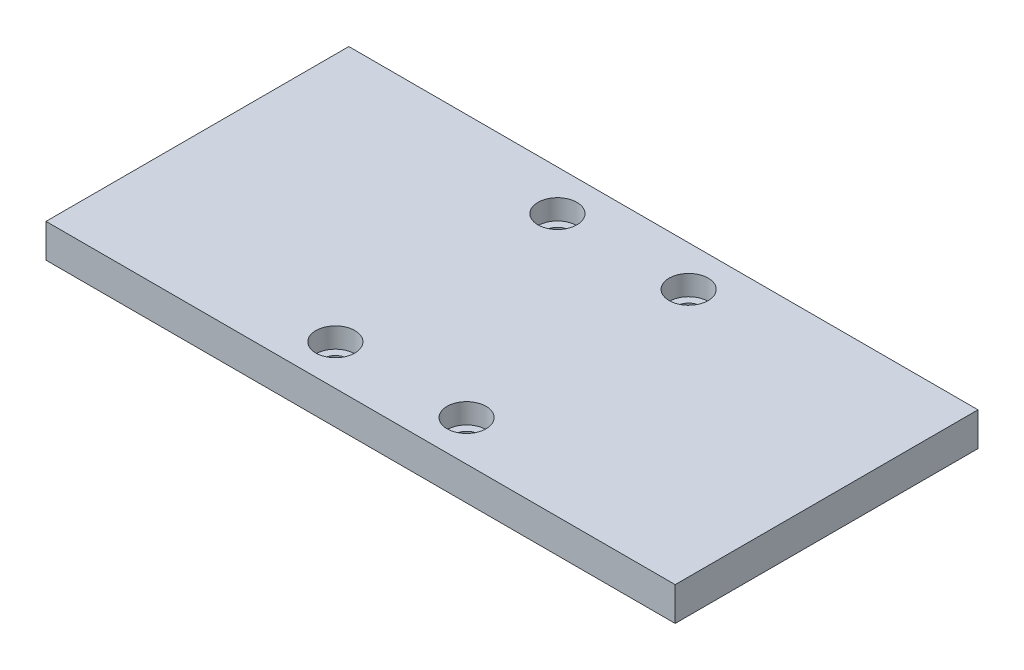
ISO-10303-21;
HEADER;
FILE_DESCRIPTION(('STEP AP214'),'2;1');
FILE_NAME('part.step','',(''),(''),'','','');
FILE_SCHEMA(('AUTOMOTIVE_DESIGN { 1 0 10303 214 1 1 1 1 }'));
ENDSEC;
DATA;
#1=APPLICATION_CONTEXT('core data for automotive mechanical design processes');
#2=APPLICATION_PROTOCOL_DEFINITION('international standard','automotive_design',2000,#1);
#3=PRODUCT_CONTEXT('',#1,'mechanical');
#4=PRODUCT('Part','Part','',(#3));
#5=PRODUCT_RELATED_PRODUCT_CATEGORY('part','',(#4));
#6=PRODUCT_DEFINITION_FORMATION('','',#4);
#7=PRODUCT_DEFINITION_CONTEXT('part definition',#1,'design');
#8=PRODUCT_DEFINITION('design','',#6,#7);
#9=PRODUCT_DEFINITION_SHAPE('','',#8);
#10=(LENGTH_UNIT() NAMED_UNIT(*) SI_UNIT(.MILLI.,.METRE.));
#11=(NAMED_UNIT(*) PLANE_ANGLE_UNIT() SI_UNIT($,.RADIAN.));
#12=(NAMED_UNIT(*) SI_UNIT($,.STERADIAN.) SOLID_ANGLE_UNIT());
#13=UNCERTAINTY_MEASURE_WITH_UNIT(LENGTH_MEASURE(1.E-05),#10,'distance_accuracy_value','');
#14=(GEOMETRIC_REPRESENTATION_CONTEXT(3) GLOBAL_UNCERTAINTY_ASSIGNED_CONTEXT((#13)) GLOBAL_UNIT_ASSIGNED_CONTEXT((#10,
#11,#12)) REPRESENTATION_CONTEXT('',''));
#15=CARTESIAN_POINT('',(0.,0.,0.));
#16=DIRECTION('',(0.,0.,1.));
#17=DIRECTION('',(1.,0.,0.));
#18=AXIS2_PLACEMENT_3D('',#15,#16,#17);
#19=CARTESIAN_POINT('',(-9.74999999999999,0.,-16.5));
#20=DIRECTION('',(0.,1.,0.));
#21=DIRECTION('',(0.,0.,1.));
#22=AXIS2_PLACEMENT_3D('',#19,#20,#21);
#23=CYLINDRICAL_SURFACE('',#22,1.75);
#24=CARTESIAN_POINT('',(-9.74999999999999,0.,-16.5));
#25=DIRECTION('',(0.,1.,0.));
#26=DIRECTION('',(0.,0.,1.));
#27=AXIS2_PLACEMENT_3D('',#24,#25,#26);
#28=CIRCLE('',#27,1.75);
#29=CARTESIAN_POINT('',(-9.74999999999999,0.,-14.75));
#30=VERTEX_POINT('',#29);
#31=EDGE_CURVE('E121',#30,#30,#28,.T.);
#32=ORIENTED_EDGE('',*,*,#31,.F.);
#33=EDGE_LOOP('',(#32));
#34=FACE_BOUND('',#33,.T.);
#35=CARTESIAN_POINT('',(-9.74999999999999,2.,-16.5));
#36=DIRECTION('',(0.,1.,0.));
#37=DIRECTION('',(0.,0.,1.));
#38=AXIS2_PLACEMENT_3D('',#35,#36,#37);
#39=CIRCLE('',#38,1.75);
#40=CARTESIAN_POINT('',(-9.74999999999999,2.,-14.75));
#41=VERTEX_POINT('',#40);
#42=EDGE_CURVE('E145',#41,#41,#39,.F.);
#43=ORIENTED_EDGE('',*,*,#42,.F.);
#44=EDGE_LOOP('',(#43));
#45=FACE_BOUND('',#44,.T.);
#46=ADVANCED_FACE('F45',(#34,#45),#23,.F.);
#47=CARTESIAN_POINT('',(-9.74999999999999,0.,16.5));
#48=DIRECTION('',(0.,1.,0.));
#49=DIRECTION('',(0.,0.,1.));
#50=AXIS2_PLACEMENT_3D('',#47,#48,#49);
#51=CYLINDRICAL_SURFACE('',#50,1.75);
#52=CARTESIAN_POINT('',(-9.74999999999999,0.,16.5));
#53=DIRECTION('',(0.,1.,0.));
#54=DIRECTION('',(0.,0.,1.));
#55=AXIS2_PLACEMENT_3D('',#52,#53,#54);
#56=CIRCLE('',#55,1.75);
#57=CARTESIAN_POINT('',(-9.74999999999999,0.,18.25));
#58=VERTEX_POINT('',#57);
#59=EDGE_CURVE('E174',#58,#58,#56,.T.);
#60=ORIENTED_EDGE('',*,*,#59,.F.);
#61=EDGE_LOOP('',(#60));
#62=FACE_BOUND('',#61,.T.);
#63=CARTESIAN_POINT('',(-9.74999999999999,2.,16.5));
#64=DIRECTION('',(0.,1.,0.));
#65=DIRECTION('',(0.,0.,1.));
#66=AXIS2_PLACEMENT_3D('',#63,#64,#65);
#67=CIRCLE('',#66,1.75);
#68=CARTESIAN_POINT('',(-9.74999999999999,2.,18.25));
#69=VERTEX_POINT('',#68);
#70=EDGE_CURVE('E141',#69,#69,#67,.F.);
#71=ORIENTED_EDGE('',*,*,#70,.F.);
#72=EDGE_LOOP('',(#71));
#73=FACE_BOUND('',#72,.T.);
#74=ADVANCED_FACE('F221',(#62,#73),#51,.F.);
#75=CARTESIAN_POINT('',(9.75000000000001,0.,16.5));
#76=DIRECTION('',(0.,1.,0.));
#77=DIRECTION('',(0.,0.,1.));
#78=AXIS2_PLACEMENT_3D('',#75,#76,#77);
#79=CYLINDRICAL_SURFACE('',#78,1.75);
#80=CARTESIAN_POINT('',(9.75000000000001,0.,16.5));
#81=DIRECTION('',(0.,1.,0.));
#82=DIRECTION('',(0.,0.,-1.));
#83=AXIS2_PLACEMENT_3D('',#80,#81,#82);
#84=CIRCLE('',#83,1.75);
#85=CARTESIAN_POINT('',(9.75000000000001,0.,14.75));
#86=VERTEX_POINT('',#85);
#87=EDGE_CURVE('E168',#86,#86,#84,.T.);
#88=ORIENTED_EDGE('',*,*,#87,.F.);
#89=EDGE_LOOP('',(#88));
#90=FACE_BOUND('',#89,.T.);
#91=CARTESIAN_POINT('',(9.75000000000001,2.,16.5));
#92=DIRECTION('',(0.,1.,0.));
#93=DIRECTION('',(0.,0.,1.));
#94=AXIS2_PLACEMENT_3D('',#91,#92,#93);
#95=CIRCLE('',#94,1.75);
#96=CARTESIAN_POINT('',(9.75000000000001,2.,18.25));
#97=VERTEX_POINT('',#96);
#98=EDGE_CURVE('E136',#97,#97,#95,.F.);
#99=ORIENTED_EDGE('',*,*,#98,.F.);
#100=EDGE_LOOP('',(#99));
#101=FACE_BOUND('',#100,.T.);
#102=ADVANCED_FACE('F228',(#90,#101),#79,.F.);
#103=CARTESIAN_POINT('',(9.74999999999999,0.,-16.5));
#104=DIRECTION('',(0.,1.,0.));
#105=DIRECTION('',(0.,0.,1.));
#106=AXIS2_PLACEMENT_3D('',#103,#104,#105);
#107=CYLINDRICAL_SURFACE('',#106,1.75);
#108=CARTESIAN_POINT('',(9.74999999999999,0.,-16.5));
#109=DIRECTION('',(0.,1.,0.));
#110=DIRECTION('',(0.,0.,-1.));
#111=AXIS2_PLACEMENT_3D('',#108,#109,#110);
#112=CIRCLE('',#111,1.75);
#113=CARTESIAN_POINT('',(9.74999999999999,0.,-18.25));
#114=VERTEX_POINT('',#113);
#115=EDGE_CURVE('E163',#114,#114,#112,.T.);
#116=ORIENTED_EDGE('',*,*,#115,.F.);
#117=EDGE_LOOP('',(#116));
#118=FACE_BOUND('',#117,.T.);
#119=CARTESIAN_POINT('',(9.74999999999999,2.,-16.5));
#120=DIRECTION('',(0.,1.,0.));
#121=DIRECTION('',(0.,0.,1.));
#122=AXIS2_PLACEMENT_3D('',#119,#120,#121);
#123=CIRCLE('',#122,1.75);
#124=CARTESIAN_POINT('',(9.74999999999999,2.,-14.75));
#125=VERTEX_POINT('',#124);
#126=EDGE_CURVE('E132',#125,#125,#123,.F.);
#127=ORIENTED_EDGE('',*,*,#126,.F.);
#128=EDGE_LOOP('',(#127));
#129=FACE_BOUND('',#128,.T.);
#130=ADVANCED_FACE('F235',(#118,#129),#107,.F.);
#131=CARTESIAN_POINT('',(-46.75,5.,22.5));
#132=DIRECTION('',(1.,0.,0.));
#133=DIRECTION('',(0.,0.,-1.));
#134=AXIS2_PLACEMENT_3D('',#131,#132,#133);
#135=PLANE('',#134);
#136=DIRECTION('',(0.,0.,1.));
#137=VECTOR('',#136,1.);
#138=CARTESIAN_POINT('',(-46.75,0.,22.5));
#139=LINE('',#138,#137);
#140=CARTESIAN_POINT('',(-46.75,0.,-22.5));
#141=VERTEX_POINT('',#140);
#142=CARTESIAN_POINT('',(-46.75,0.,22.5));
#143=VERTEX_POINT('',#142);
#144=EDGE_CURVE('E117',#141,#143,#139,.T.);
#145=ORIENTED_EDGE('',*,*,#144,.T.);
#146=DIRECTION('',(0.,-1.,0.));
#147=VECTOR('',#146,1.);
#148=CARTESIAN_POINT('',(-46.75,5.,22.5));
#149=LINE('',#148,#147);
#150=CARTESIAN_POINT('',(-46.75,5.,22.5));
#151=VERTEX_POINT('',#150);
#152=EDGE_CURVE('E11',#151,#143,#149,.T.);
#153=ORIENTED_EDGE('',*,*,#152,.F.);
#154=DIRECTION('',(0.,0.,1.));
#155=VECTOR('',#154,1.);
#156=CARTESIAN_POINT('',(-46.75,5.,22.5));
#157=LINE('',#156,#155);
#158=CARTESIAN_POINT('',(-46.75,5.,-22.5));
#159=VERTEX_POINT('',#158);
#160=EDGE_CURVE('E100',#159,#151,#157,.T.);
#161=ORIENTED_EDGE('',*,*,#160,.F.);
#162=DIRECTION('',(0.,-1.,0.));
#163=VECTOR('',#162,1.);
#164=CARTESIAN_POINT('',(-46.75,5.,-22.5));
#165=LINE('',#164,#163);
#166=EDGE_CURVE('E113',#159,#141,#165,.T.);
#167=ORIENTED_EDGE('',*,*,#166,.T.);
#168=EDGE_LOOP('',(#145,#153,#161,#167));
#169=FACE_BOUND('',#168,.T.);
#170=ADVANCED_FACE('F47',(#169),#135,.F.);
#171=CARTESIAN_POINT('',(46.75,5.,22.5));
#172=DIRECTION('',(0.,0.,-1.));
#173=DIRECTION('',(-1.,0.,0.));
#174=AXIS2_PLACEMENT_3D('',#171,#172,#173);
#175=PLANE('',#174);
#176=DIRECTION('',(1.,0.,0.));
#177=VECTOR('',#176,1.);
#178=CARTESIAN_POINT('',(46.75,0.,22.5));
#179=LINE('',#178,#177);
#180=CARTESIAN_POINT('',(46.75,0.,22.5));
#181=VERTEX_POINT('',#180);
#182=EDGE_CURVE('E105',#143,#181,#179,.T.);
#183=ORIENTED_EDGE('',*,*,#182,.T.);
#184=DIRECTION('',(0.,-1.,0.));
#185=VECTOR('',#184,1.);
#186=CARTESIAN_POINT('',(46.75,5.,22.5));
#187=LINE('',#186,#185);
#188=CARTESIAN_POINT('',(46.75,5.,22.5));
#189=VERTEX_POINT('',#188);
#190=EDGE_CURVE('E56',#189,#181,#187,.T.);
#191=ORIENTED_EDGE('',*,*,#190,.F.);
#192=DIRECTION('',(1.,0.,0.));
#193=VECTOR('',#192,1.);
#194=CARTESIAN_POINT('',(46.75,5.,22.5));
#195=LINE('',#194,#193);
#196=EDGE_CURVE('E95',#151,#189,#195,.T.);
#197=ORIENTED_EDGE('',*,*,#196,.F.);
#198=ORIENTED_EDGE('',*,*,#152,.T.);
#199=EDGE_LOOP('',(#183,#191,#197,#198));
#200=FACE_BOUND('',#199,.T.);
#201=ADVANCED_FACE('F104',(#200),#175,.F.);
#202=CARTESIAN_POINT('',(46.75,5.,22.5));
#203=DIRECTION('',(-1.,0.,0.));
#204=DIRECTION('',(0.,0.,1.));
#205=AXIS2_PLACEMENT_3D('',#202,#203,#204);
#206=PLANE('',#205);
#207=DIRECTION('',(0.,0.,-1.));
#208=VECTOR('',#207,1.);
#209=CARTESIAN_POINT('',(46.75,0.,22.5));
#210=LINE('',#209,#208);
#211=CARTESIAN_POINT('',(46.75,0.,-22.5));
#212=VERTEX_POINT('',#211);
#213=EDGE_CURVE('E82',#181,#212,#210,.T.);
#214=ORIENTED_EDGE('',*,*,#213,.T.);
#215=DIRECTION('',(0.,-1.,0.));
#216=VECTOR('',#215,1.);
#217=CARTESIAN_POINT('',(46.75,5.,-22.5));
#218=LINE('',#217,#216);
#219=CARTESIAN_POINT('',(46.75,5.,-22.5));
#220=VERTEX_POINT('',#219);
#221=EDGE_CURVE('E107',#220,#212,#218,.T.);
#222=ORIENTED_EDGE('',*,*,#221,.F.);
#223=DIRECTION('',(0.,0.,-1.));
#224=VECTOR('',#223,1.);
#225=CARTESIAN_POINT('',(46.75,5.,22.5));
#226=LINE('',#225,#224);
#227=EDGE_CURVE('E98',#189,#220,#226,.T.);
#228=ORIENTED_EDGE('',*,*,#227,.F.);
#229=ORIENTED_EDGE('',*,*,#190,.T.);
#230=EDGE_LOOP('',(#214,#222,#228,#229));
#231=FACE_BOUND('',#230,.T.);
#232=ADVANCED_FACE('F109',(#231),#206,.F.);
#233=CARTESIAN_POINT('',(46.75,5.,-22.5));
#234=DIRECTION('',(0.,0.,1.));
#235=DIRECTION('',(1.,0.,0.));
#236=AXIS2_PLACEMENT_3D('',#233,#234,#235);
#237=PLANE('',#236);
#238=DIRECTION('',(-1.,0.,0.));
#239=VECTOR('',#238,1.);
#240=CARTESIAN_POINT('',(46.75,0.,-22.5));
#241=LINE('',#240,#239);
#242=EDGE_CURVE('E88',#212,#141,#241,.T.);
#243=ORIENTED_EDGE('',*,*,#242,.T.);
#244=ORIENTED_EDGE('',*,*,#166,.F.);
#245=DIRECTION('',(-1.,0.,0.));
#246=VECTOR('',#245,1.);
#247=CARTESIAN_POINT('',(46.75,5.,-22.5));
#248=LINE('',#247,#246);
#249=EDGE_CURVE('E65',#220,#159,#248,.T.);
#250=ORIENTED_EDGE('',*,*,#249,.F.);
#251=ORIENTED_EDGE('',*,*,#221,.T.);
#252=EDGE_LOOP('',(#243,#244,#250,#251));
#253=FACE_BOUND('',#252,.T.);
#254=ADVANCED_FACE('F239',(#253),#237,.F.);
#255=CARTESIAN_POINT('',(0.,5.,0.));
#256=DIRECTION('',(0.,1.,0.));
#257=DIRECTION('',(0.,0.,1.));
#258=AXIS2_PLACEMENT_3D('',#255,#256,#257);
#259=PLANE('',#258);
#260=CARTESIAN_POINT('',(-9.74999999999999,5.,16.5));
#261=DIRECTION('',(0.,1.,0.));
#262=DIRECTION('',(0.,0.,1.));
#263=AXIS2_PLACEMENT_3D('',#260,#261,#262);
#264=CIRCLE('',#263,2.9);
#265=CARTESIAN_POINT('',(-9.74999999999999,5.,19.4));
#266=VERTEX_POINT('',#265);
#267=EDGE_CURVE('E49',#266,#266,#264,.F.);
#268=ORIENTED_EDGE('',*,*,#267,.T.);
#269=EDGE_LOOP('',(#268));
#270=FACE_BOUND('',#269,.T.);
#271=CARTESIAN_POINT('',(9.75000000000001,5.,16.5));
#272=DIRECTION('',(0.,1.,0.));
#273=DIRECTION('',(0.,0.,1.));
#274=AXIS2_PLACEMENT_3D('',#271,#272,#273);
#275=CIRCLE('',#274,2.9);
#276=CARTESIAN_POINT('',(9.75000000000001,5.,19.4));
#277=VERTEX_POINT('',#276);
#278=EDGE_CURVE('E156',#277,#277,#275,.F.);
#279=ORIENTED_EDGE('',*,*,#278,.T.);
#280=EDGE_LOOP('',(#279));
#281=FACE_BOUND('',#280,.T.);
#282=CARTESIAN_POINT('',(9.74999999999999,5.,-16.5));
#283=DIRECTION('',(0.,1.,0.));
#284=DIRECTION('',(0.,0.,1.));
#285=AXIS2_PLACEMENT_3D('',#282,#283,#284);
#286=CIRCLE('',#285,2.9);
#287=CARTESIAN_POINT('',(9.74999999999999,5.,-13.6));
#288=VERTEX_POINT('',#287);
#289=EDGE_CURVE('E153',#288,#288,#286,.F.);
#290=ORIENTED_EDGE('',*,*,#289,.T.);
#291=EDGE_LOOP('',(#290));
#292=FACE_BOUND('',#291,.T.);
#293=CARTESIAN_POINT('',(-9.74999999999999,5.,-16.5));
#294=DIRECTION('',(0.,1.,0.));
#295=DIRECTION('',(0.,0.,1.));
#296=AXIS2_PLACEMENT_3D('',#293,#294,#295);
#297=CIRCLE('',#296,2.9);
#298=CARTESIAN_POINT('',(-9.74999999999999,5.,-13.6));
#299=VERTEX_POINT('',#298);
#300=EDGE_CURVE('E149',#299,#299,#297,.F.);
#301=ORIENTED_EDGE('',*,*,#300,.T.);
#302=EDGE_LOOP('',(#301));
#303=FACE_BOUND('',#302,.T.);
#304=ORIENTED_EDGE('',*,*,#160,.T.);
#305=ORIENTED_EDGE('',*,*,#196,.T.);
#306=ORIENTED_EDGE('',*,*,#227,.T.);
#307=ORIENTED_EDGE('',*,*,#249,.T.);
#308=EDGE_LOOP('',(#304,#305,#306,#307));
#309=FACE_BOUND('',#308,.T.);
#310=ADVANCED_FACE('F96',(#270,#281,#292,#303,#309),#259,.T.);
#311=CARTESIAN_POINT('',(0.,0.,0.));
#312=DIRECTION('',(0.,1.,0.));
#313=DIRECTION('',(0.,0.,1.));
#314=AXIS2_PLACEMENT_3D('',#311,#312,#313);
#315=PLANE('',#314);
#316=ORIENTED_EDGE('',*,*,#115,.T.);
#317=EDGE_LOOP('',(#316));
#318=FACE_BOUND('',#317,.T.);
#319=ORIENTED_EDGE('',*,*,#87,.T.);
#320=EDGE_LOOP('',(#319));
#321=FACE_BOUND('',#320,.T.);
#322=ORIENTED_EDGE('',*,*,#59,.T.);
#323=EDGE_LOOP('',(#322));
#324=FACE_BOUND('',#323,.T.);
#325=ORIENTED_EDGE('',*,*,#31,.T.);
#326=EDGE_LOOP('',(#325));
#327=FACE_BOUND('',#326,.T.);
#328=ORIENTED_EDGE('',*,*,#144,.F.);
#329=ORIENTED_EDGE('',*,*,#242,.F.);
#330=ORIENTED_EDGE('',*,*,#213,.F.);
#331=ORIENTED_EDGE('',*,*,#182,.F.);
#332=EDGE_LOOP('',(#328,#329,#330,#331));
#333=FACE_BOUND('',#332,.T.);
#334=ADVANCED_FACE('F217',(#318,#321,#324,#327,#333),#315,.F.);
#335=CARTESIAN_POINT('',(9.74999999999999,2.,-16.5));
#336=DIRECTION('',(0.,1.,0.));
#337=DIRECTION('',(0.,0.,1.));
#338=AXIS2_PLACEMENT_3D('',#335,#336,#337);
#339=PLANE('',#338);
#340=CARTESIAN_POINT('',(9.74999999999999,2.,-16.5));
#341=DIRECTION('',(0.,1.,0.));
#342=DIRECTION('',(0.,0.,1.));
#343=AXIS2_PLACEMENT_3D('',#340,#341,#342);
#344=CIRCLE('',#343,2.9);
#345=CARTESIAN_POINT('',(9.74999999999999,2.,-13.6));
#346=VERTEX_POINT('',#345);
#347=EDGE_CURVE('E189',#346,#346,#344,.T.);
#348=ORIENTED_EDGE('',*,*,#347,.T.);
#349=EDGE_LOOP('',(#348));
#350=FACE_BOUND('',#349,.T.);
#351=ORIENTED_EDGE('',*,*,#126,.T.);
#352=EDGE_LOOP('',(#351));
#353=FACE_BOUND('',#352,.T.);
#354=ADVANCED_FACE('F202',(#350,#353),#339,.T.);
#355=CARTESIAN_POINT('',(9.74999999999999,5.000012,-16.5));
#356=DIRECTION('',(0.,-1.,0.));
#357=DIRECTION('',(0.,0.,-1.));
#358=AXIS2_PLACEMENT_3D('',#355,#356,#357);
#359=CYLINDRICAL_SURFACE('',#358,2.9);
#360=ORIENTED_EDGE('',*,*,#289,.F.);
#361=EDGE_LOOP('',(#360));
#362=FACE_BOUND('',#361,.T.);
#363=ORIENTED_EDGE('',*,*,#347,.F.);
#364=EDGE_LOOP('',(#363));
#365=FACE_BOUND('',#364,.T.);
#366=ADVANCED_FACE('F205',(#362,#365),#359,.F.);
#367=CARTESIAN_POINT('',(9.75000000000001,2.,16.5));
#368=DIRECTION('',(0.,1.,0.));
#369=DIRECTION('',(0.,0.,1.));
#370=AXIS2_PLACEMENT_3D('',#367,#368,#369);
#371=PLANE('',#370);
#372=CARTESIAN_POINT('',(9.75000000000001,2.,16.5));
#373=DIRECTION('',(0.,1.,0.));
#374=DIRECTION('',(0.,0.,1.));
#375=AXIS2_PLACEMENT_3D('',#372,#373,#374);
#376=CIRCLE('',#375,2.9);
#377=CARTESIAN_POINT('',(9.75000000000001,2.,19.4));
#378=VERTEX_POINT('',#377);
#379=EDGE_CURVE('E194',#378,#378,#376,.T.);
#380=ORIENTED_EDGE('',*,*,#379,.T.);
#381=EDGE_LOOP('',(#380));
#382=FACE_BOUND('',#381,.T.);
#383=ORIENTED_EDGE('',*,*,#98,.T.);
#384=EDGE_LOOP('',(#383));
#385=FACE_BOUND('',#384,.T.);
#386=ADVANCED_FACE('F207',(#382,#385),#371,.T.);
#387=CARTESIAN_POINT('',(9.75000000000001,5.000012,16.5));
#388=DIRECTION('',(0.,-1.,0.));
#389=DIRECTION('',(0.,0.,-1.));
#390=AXIS2_PLACEMENT_3D('',#387,#388,#389);
#391=CYLINDRICAL_SURFACE('',#390,2.9);
#392=ORIENTED_EDGE('',*,*,#278,.F.);
#393=EDGE_LOOP('',(#392));
#394=FACE_BOUND('',#393,.T.);
#395=ORIENTED_EDGE('',*,*,#379,.F.);
#396=EDGE_LOOP('',(#395));
#397=FACE_BOUND('',#396,.T.);
#398=ADVANCED_FACE('F214',(#394,#397),#391,.F.);
#399=CARTESIAN_POINT('',(-9.74999999999999,2.,16.5));
#400=DIRECTION('',(0.,1.,0.));
#401=DIRECTION('',(0.,0.,1.));
#402=AXIS2_PLACEMENT_3D('',#399,#400,#401);
#403=PLANE('',#402);
#404=CARTESIAN_POINT('',(-9.74999999999999,2.,16.5));
#405=DIRECTION('',(0.,1.,0.));
#406=DIRECTION('',(0.,0.,1.));
#407=AXIS2_PLACEMENT_3D('',#404,#405,#406);
#408=CIRCLE('',#407,2.9);
#409=CARTESIAN_POINT('',(-9.74999999999999,2.,19.4));
#410=VERTEX_POINT('',#409);
#411=EDGE_CURVE('E190',#410,#410,#408,.T.);
#412=ORIENTED_EDGE('',*,*,#411,.T.);
#413=EDGE_LOOP('',(#412));
#414=FACE_BOUND('',#413,.T.);
#415=ORIENTED_EDGE('',*,*,#70,.T.);
#416=EDGE_LOOP('',(#415));
#417=FACE_BOUND('',#416,.T.);
#418=ADVANCED_FACE('F275',(#414,#417),#403,.T.);
#419=CARTESIAN_POINT('',(-9.74999999999999,5.000012,16.5));
#420=DIRECTION('',(0.,-1.,0.));
#421=DIRECTION('',(0.,0.,-1.));
#422=AXIS2_PLACEMENT_3D('',#419,#420,#421);
#423=CYLINDRICAL_SURFACE('',#422,2.9);
#424=ORIENTED_EDGE('',*,*,#267,.F.);
#425=EDGE_LOOP('',(#424));
#426=FACE_BOUND('',#425,.T.);
#427=ORIENTED_EDGE('',*,*,#411,.F.);
#428=EDGE_LOOP('',(#427));
#429=FACE_BOUND('',#428,.T.);
#430=ADVANCED_FACE('F273',(#426,#429),#423,.F.);
#431=CARTESIAN_POINT('',(-9.74999999999999,2.,-16.5));
#432=DIRECTION('',(0.,1.,0.));
#433=DIRECTION('',(0.,0.,1.));
#434=AXIS2_PLACEMENT_3D('',#431,#432,#433);
#435=PLANE('',#434);
#436=CARTESIAN_POINT('',(-9.74999999999999,2.,-16.5));
#437=DIRECTION('',(0.,1.,0.));
#438=DIRECTION('',(0.,0.,1.));
#439=AXIS2_PLACEMENT_3D('',#436,#437,#438);
#440=CIRCLE('',#439,2.9);
#441=CARTESIAN_POINT('',(-9.74999999999999,2.,-13.6));
#442=VERTEX_POINT('',#441);
#443=EDGE_CURVE('E137',#442,#442,#440,.T.);
#444=ORIENTED_EDGE('',*,*,#443,.T.);
#445=EDGE_LOOP('',(#444));
#446=FACE_BOUND('',#445,.T.);
#447=ORIENTED_EDGE('',*,*,#42,.T.);
#448=EDGE_LOOP('',(#447));
#449=FACE_BOUND('',#448,.T.);
#450=ADVANCED_FACE('F269',(#446,#449),#435,.T.);
#451=CARTESIAN_POINT('',(-9.74999999999999,5.000012,-16.5));
#452=DIRECTION('',(0.,-1.,0.));
#453=DIRECTION('',(0.,0.,-1.));
#454=AXIS2_PLACEMENT_3D('',#451,#452,#453);
#455=CYLINDRICAL_SURFACE('',#454,2.9);
#456=ORIENTED_EDGE('',*,*,#300,.F.);
#457=EDGE_LOOP('',(#456));
#458=FACE_BOUND('',#457,.T.);
#459=ORIENTED_EDGE('',*,*,#443,.F.);
#460=EDGE_LOOP('',(#459));
#461=FACE_BOUND('',#460,.T.);
#462=ADVANCED_FACE('F266',(#458,#461),#455,.F.);
#463=CLOSED_SHELL('',(#46,#74,#102,#130,#170,#201,#232,#254,#310,#334,#354,#366,#386,#398,#418,
#430,#450,#462));
#464=MANIFOLD_SOLID_BREP('B2',#463);
#465=ADVANCED_BREP_SHAPE_REPRESENTATION('',(#18,#464),#14);
#466=SHAPE_DEFINITION_REPRESENTATION(#9,#465);
ENDSEC;
END-ISO-10303-21;
